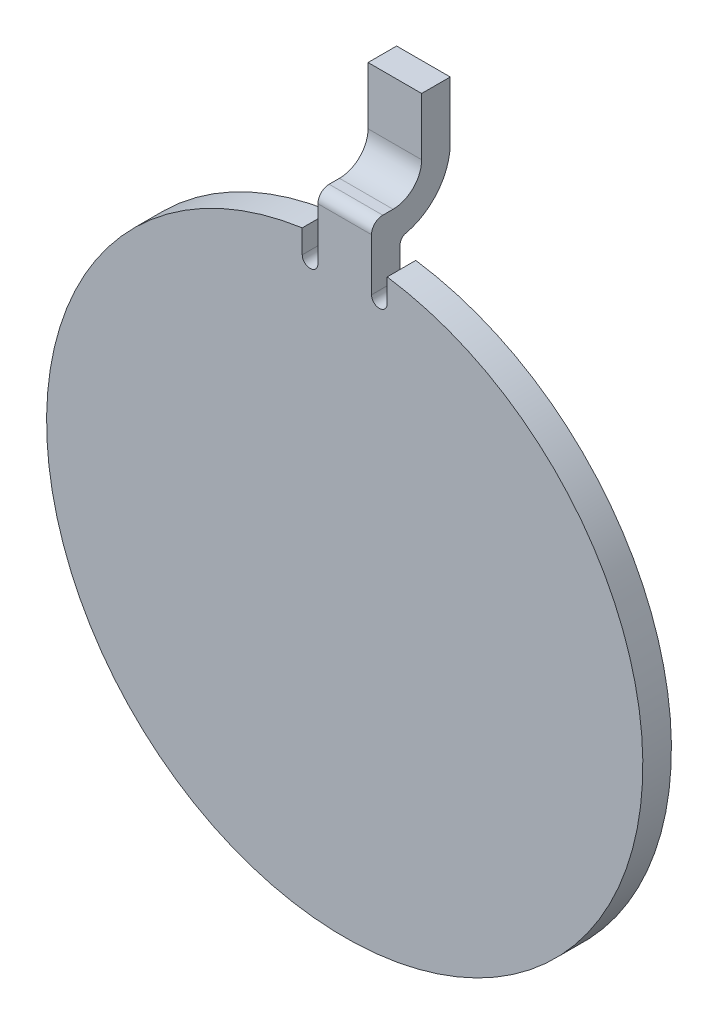
ISO-10303-21;
HEADER;
FILE_DESCRIPTION(('STEP AP214'),'2;1');
FILE_NAME('part.step','',(''),(''),'','','');
FILE_SCHEMA(('AUTOMOTIVE_DESIGN { 1 0 10303 214 1 1 1 1 }'));
ENDSEC;
DATA;
#1=APPLICATION_CONTEXT('core data for automotive mechanical design processes');
#2=APPLICATION_PROTOCOL_DEFINITION('international standard','automotive_design',2000,#1);
#3=PRODUCT_CONTEXT('',#1,'mechanical');
#4=PRODUCT('Part','Part','',(#3));
#5=PRODUCT_RELATED_PRODUCT_CATEGORY('part','',(#4));
#6=PRODUCT_DEFINITION_FORMATION('','',#4);
#7=PRODUCT_DEFINITION_CONTEXT('part definition',#1,'design');
#8=PRODUCT_DEFINITION('design','',#6,#7);
#9=PRODUCT_DEFINITION_SHAPE('','',#8);
#10=(LENGTH_UNIT() NAMED_UNIT(*) SI_UNIT(.MILLI.,.METRE.));
#11=(NAMED_UNIT(*) PLANE_ANGLE_UNIT() SI_UNIT($,.RADIAN.));
#12=(NAMED_UNIT(*) SI_UNIT($,.STERADIAN.) SOLID_ANGLE_UNIT());
#13=UNCERTAINTY_MEASURE_WITH_UNIT(LENGTH_MEASURE(1.E-05),#10,'distance_accuracy_value','');
#14=(GEOMETRIC_REPRESENTATION_CONTEXT(3) GLOBAL_UNCERTAINTY_ASSIGNED_CONTEXT((#13)) GLOBAL_UNIT_ASSIGNED_CONTEXT((#10,
#11,#12)) REPRESENTATION_CONTEXT('',''));
#15=CARTESIAN_POINT('',(0.,0.,0.));
#16=DIRECTION('',(0.,0.,1.));
#17=DIRECTION('',(1.,0.,0.));
#18=AXIS2_PLACEMENT_3D('',#15,#16,#17);
#19=CARTESIAN_POINT('',(-0.476507589397102,37.7055196206584,10.668));
#20=DIRECTION('',(0.,-1.,0.));
#21=DIRECTION('',(0.,0.,-1.));
#22=AXIS2_PLACEMENT_3D('',#19,#20,#21);
#23=PLANE('',#22);
#24=DIRECTION('',(0.,0.,1.));
#25=VECTOR('',#24,1.);
#26=CARTESIAN_POINT('',(-0.476507589397102,37.7055196206584,10.668));
#27=LINE('',#26,#25);
#28=CARTESIAN_POINT('',(-0.476507589397102,37.7055196206584,10.7928766138095));
#29=VERTEX_POINT('',#28);
#30=CARTESIAN_POINT('',(-0.476507589397102,37.7055196206584,10.976));
#31=VERTEX_POINT('',#30);
#32=EDGE_CURVE('E238',#29,#31,#27,.T.);
#33=ORIENTED_EDGE('',*,*,#32,.T.);
#34=DIRECTION('',(1.,0.,0.));
#35=VECTOR('',#34,1.);
#36=CARTESIAN_POINT('',(-0.476507589397102,37.7055196206584,10.976));
#37=LINE('',#36,#35);
#38=CARTESIAN_POINT('',(0.476507589397102,37.7055196206584,10.976));
#39=VERTEX_POINT('',#38);
#40=EDGE_CURVE('E251',#31,#39,#37,.T.);
#41=ORIENTED_EDGE('',*,*,#40,.T.);
#42=DIRECTION('',(0.,0.,1.));
#43=VECTOR('',#42,1.);
#44=CARTESIAN_POINT('',(0.476507589397102,37.7055196206584,10.668));
#45=LINE('',#44,#43);
#46=CARTESIAN_POINT('',(0.476507589397102,37.7055196206584,10.7928766138095));
#47=VERTEX_POINT('',#46);
#48=EDGE_CURVE('E233',#47,#39,#45,.T.);
#49=ORIENTED_EDGE('',*,*,#48,.F.);
#50=DIRECTION('',(-1.,0.,0.));
#51=VECTOR('',#50,1.);
#52=CARTESIAN_POINT('',(0.476507589397102,37.7055196206584,10.7928766138095));
#53=LINE('',#52,#51);
#54=EDGE_CURVE('E219',#47,#29,#53,.T.);
#55=ORIENTED_EDGE('',*,*,#54,.T.);
#56=EDGE_LOOP('',(#33,#41,#49,#55));
#57=FACE_BOUND('',#56,.T.);
#58=ADVANCED_FACE('F36',(#57),#23,.F.);
#59=CARTESIAN_POINT('',(0.,31.75,10.668));
#60=DIRECTION('',(0.,0.,-1.));
#61=DIRECTION('',(-1.,0.,0.));
#62=AXIS2_PLACEMENT_3D('',#59,#60,#61);
#63=PLANE('',#62);
#64=DIRECTION('',(0.,-1.,0.));
#65=VECTOR('',#64,1.);
#66=CARTESIAN_POINT('',(0.476507589397102,37.0276368196465,10.668));
#67=LINE('',#66,#65);
#68=CARTESIAN_POINT('',(0.476507589397102,37.0986173059169,10.668));
#69=VERTEX_POINT('',#68);
#70=CARTESIAN_POINT('',(0.476507589397102,36.5801523813832,10.668));
#71=VERTEX_POINT('',#70);
#72=EDGE_CURVE('E228',#69,#71,#67,.T.);
#73=ORIENTED_EDGE('',*,*,#72,.T.);
#74=CARTESIAN_POINT('',(0.615801998549159,36.5801523813832,10.668));
#75=DIRECTION('',(0.,0.,-1.));
#76=DIRECTION('',(1.,0.,0.));
#77=AXIS2_PLACEMENT_3D('',#74,#75,#76);
#78=CIRCLE('',#77,0.139294409152057);
#79=CARTESIAN_POINT('',(0.755096407701217,36.5801523813832,10.668));
#80=VERTEX_POINT('',#79);
#81=EDGE_CURVE('E159',#80,#71,#78,.T.);
#82=ORIENTED_EDGE('',*,*,#81,.F.);
#83=DIRECTION('',(0.,-1.,0.));
#84=VECTOR('',#83,1.);
#85=CARTESIAN_POINT('',(0.755096407701217,37.0838705948078,10.668));
#86=LINE('',#85,#84);
#87=CARTESIAN_POINT('',(0.755096407701217,36.9950299615844,10.668));
#88=VERTEX_POINT('',#87);
#89=EDGE_CURVE('E167',#88,#80,#86,.T.);
#90=ORIENTED_EDGE('',*,*,#89,.F.);
#91=CARTESIAN_POINT('',(0.,31.75,10.668));
#92=DIRECTION('',(0.,0.,-1.));
#93=DIRECTION('',(-1.,0.,0.));
#94=AXIS2_PLACEMENT_3D('',#91,#92,#93);
#95=CIRCLE('',#94,5.29910463029755);
#96=CARTESIAN_POINT('',(-0.755096407701217,36.9950299615844,10.668));
#97=VERTEX_POINT('',#96);
#98=EDGE_CURVE('E230',#88,#97,#95,.T.);
#99=ORIENTED_EDGE('',*,*,#98,.T.);
#100=DIRECTION('',(0.,1.,0.));
#101=VECTOR('',#100,1.);
#102=CARTESIAN_POINT('',(-0.755096407701217,37.0838705948078,10.668));
#103=LINE('',#102,#101);
#104=CARTESIAN_POINT('',(-0.755096407701217,36.5801523813832,10.668));
#105=VERTEX_POINT('',#104);
#106=EDGE_CURVE('E177',#105,#97,#103,.T.);
#107=ORIENTED_EDGE('',*,*,#106,.F.);
#108=CARTESIAN_POINT('',(-0.615801998549159,36.5801523813832,10.668));
#109=DIRECTION('',(0.,0.,-1.));
#110=DIRECTION('',(-1.,0.,0.));
#111=AXIS2_PLACEMENT_3D('',#108,#109,#110);
#112=CIRCLE('',#111,0.139294409152057);
#113=CARTESIAN_POINT('',(-0.476507589397102,36.5801523813832,10.668));
#114=VERTEX_POINT('',#113);
#115=EDGE_CURVE('E173',#114,#105,#112,.T.);
#116=ORIENTED_EDGE('',*,*,#115,.F.);
#117=DIRECTION('',(0.,1.,0.));
#118=VECTOR('',#117,1.);
#119=CARTESIAN_POINT('',(-0.476507589397102,37.0276368196465,10.668));
#120=LINE('',#119,#118);
#121=CARTESIAN_POINT('',(-0.476507589397102,37.0986173059169,10.668));
#122=VERTEX_POINT('',#121);
#123=EDGE_CURVE('E232',#114,#122,#120,.T.);
#124=ORIENTED_EDGE('',*,*,#123,.T.);
#125=DIRECTION('',(-1.,0.,0.));
#126=VECTOR('',#125,1.);
#127=CARTESIAN_POINT('',(0.,37.0986173059169,10.668));
#128=LINE('',#127,#126);
#129=EDGE_CURVE('E241',#122,#69,#128,.F.);
#130=ORIENTED_EDGE('',*,*,#129,.T.);
#131=EDGE_LOOP('',(#73,#82,#90,#99,#107,#116,#124,#130));
#132=FACE_BOUND('',#131,.T.);
#133=ADVANCED_FACE('F279',(#132),#63,.T.);
#134=CARTESIAN_POINT('',(0.476507589397102,37.0276368196465,10.668));
#135=DIRECTION('',(-1.,0.,0.));
#136=DIRECTION('',(0.,0.,1.));
#137=AXIS2_PLACEMENT_3D('',#134,#135,#136);
#138=PLANE('',#137);
#139=DIRECTION('',(0.,-1.,0.));
#140=VECTOR('',#139,1.);
#141=CARTESIAN_POINT('',(0.476507589397102,37.0276368196465,11.176));
#142=LINE('',#141,#140);
#143=CARTESIAN_POINT('',(0.476507589397102,37.5055196206584,11.176));
#144=VERTEX_POINT('',#143);
#145=CARTESIAN_POINT('',(0.476507589397102,36.5801523813832,11.176));
#146=VERTEX_POINT('',#145);
#147=EDGE_CURVE('E146',#144,#146,#142,.T.);
#148=ORIENTED_EDGE('',*,*,#147,.T.);
#149=DIRECTION('',(0.,0.,-1.));
#150=VECTOR('',#149,1.);
#151=CARTESIAN_POINT('',(0.476507589397102,36.5801523813832,11.176));
#152=LINE('',#151,#150);
#153=EDGE_CURVE('E149',#146,#71,#152,.T.);
#154=ORIENTED_EDGE('',*,*,#153,.T.);
#155=ORIENTED_EDGE('',*,*,#72,.F.);
#156=CARTESIAN_POINT('',(0.476507589397102,37.0986173059169,10.541));
#157=DIRECTION('',(-1.,0.,0.));
#158=DIRECTION('',(0.,0.,1.));
#159=AXIS2_PLACEMENT_3D('',#156,#157,#158);
#160=CIRCLE('',#159,0.127);
#161=CARTESIAN_POINT('',(0.476507589397102,37.2224953408882,10.5689862904233));
#162=VERTEX_POINT('',#161);
#163=EDGE_CURVE('E246',#69,#162,#160,.T.);
#164=ORIENTED_EDGE('',*,*,#163,.T.);
#165=CARTESIAN_POINT('',(0.476507589397102,38.2135196206584,10.7928766138095));
#166=DIRECTION('',(-1.,0.,0.));
#167=DIRECTION('',(0.,0.,1.));
#168=AXIS2_PLACEMENT_3D('',#165,#166,#167);
#169=CIRCLE('',#168,1.016);
#170=CARTESIAN_POINT('',(0.476507589397102,38.2135196206584,9.7768766138095));
#171=VERTEX_POINT('',#170);
#172=EDGE_CURVE('E201',#162,#171,#169,.F.);
#173=ORIENTED_EDGE('',*,*,#172,.T.);
#174=DIRECTION('',(0.,1.,0.));
#175=VECTOR('',#174,1.);
#176=CARTESIAN_POINT('',(0.476507589397102,38.2135196206584,9.7768766138095));
#177=LINE('',#176,#175);
#178=CARTESIAN_POINT('',(0.476507589397102,39.2339446156029,9.7768766138095));
#179=VERTEX_POINT('',#178);
#180=EDGE_CURVE('E199',#171,#179,#177,.T.);
#181=ORIENTED_EDGE('',*,*,#180,.T.);
#182=DIRECTION('',(0.,0.,1.));
#183=VECTOR('',#182,1.);
#184=CARTESIAN_POINT('',(0.476507589397102,39.2339446156029,9.7768766138095));
#185=LINE('',#184,#183);
#186=CARTESIAN_POINT('',(0.476507589397102,39.2339446156029,10.2848766138095));
#187=VERTEX_POINT('',#186);
#188=EDGE_CURVE('E196',#179,#187,#185,.T.);
#189=ORIENTED_EDGE('',*,*,#188,.T.);
#190=DIRECTION('',(0.,1.,0.));
#191=VECTOR('',#190,1.);
#192=CARTESIAN_POINT('',(0.476507589397102,38.2135196206584,10.2848766138095));
#193=LINE('',#192,#191);
#194=CARTESIAN_POINT('',(0.476507589397102,38.2135196206584,10.2848766138095));
#195=VERTEX_POINT('',#194);
#196=EDGE_CURVE('E193',#195,#187,#193,.T.);
#197=ORIENTED_EDGE('',*,*,#196,.F.);
#198=CARTESIAN_POINT('',(0.476507589397102,38.2135196206584,10.7928766138095));
#199=DIRECTION('',(1.,0.,0.));
#200=DIRECTION('',(0.,0.,-1.));
#201=AXIS2_PLACEMENT_3D('',#198,#199,#200);
#202=CIRCLE('',#201,0.508000000000001);
#203=EDGE_CURVE('E203',#47,#195,#202,.T.);
#204=ORIENTED_EDGE('',*,*,#203,.F.);
#205=ORIENTED_EDGE('',*,*,#48,.T.);
#206=CARTESIAN_POINT('',(0.476507589397102,37.5055196206584,10.976));
#207=DIRECTION('',(-1.,0.,0.));
#208=DIRECTION('',(0.,0.,1.));
#209=AXIS2_PLACEMENT_3D('',#206,#207,#208);
#210=CIRCLE('',#209,0.2);
#211=EDGE_CURVE('E152',#39,#144,#210,.F.);
#212=ORIENTED_EDGE('',*,*,#211,.T.);
#213=EDGE_LOOP('',(#148,#154,#155,#164,#173,#181,#189,#197,#204,#205,#212));
#214=FACE_BOUND('',#213,.T.);
#215=ADVANCED_FACE('F147',(#214),#138,.F.);
#216=CARTESIAN_POINT('',(0.,31.75,10.668));
#217=DIRECTION('',(0.,0.,1.));
#218=DIRECTION('',(1.,0.,0.));
#219=AXIS2_PLACEMENT_3D('',#216,#217,#218);
#220=CYLINDRICAL_SURFACE('',#219,5.29910463029755);
#221=ORIENTED_EDGE('',*,*,#98,.F.);
#222=DIRECTION('',(0.,0.,1.));
#223=VECTOR('',#222,1.);
#224=CARTESIAN_POINT('',(0.755096407701217,36.9950299615844,10.668));
#225=LINE('',#224,#223);
#226=CARTESIAN_POINT('',(0.755096407701217,36.9950299615844,11.176));
#227=VERTEX_POINT('',#226);
#228=EDGE_CURVE('E160',#88,#227,#225,.T.);
#229=ORIENTED_EDGE('',*,*,#228,.T.);
#230=CARTESIAN_POINT('',(0.,31.75,11.176));
#231=DIRECTION('',(0.,0.,-1.));
#232=DIRECTION('',(-1.,0.,0.));
#233=AXIS2_PLACEMENT_3D('',#230,#231,#232);
#234=CIRCLE('',#233,5.29910463029755);
#235=CARTESIAN_POINT('',(-0.755096407701217,36.9950299615844,11.176));
#236=VERTEX_POINT('',#235);
#237=EDGE_CURVE('E154',#227,#236,#234,.T.);
#238=ORIENTED_EDGE('',*,*,#237,.T.);
#239=DIRECTION('',(0.,0.,1.));
#240=VECTOR('',#239,1.);
#241=CARTESIAN_POINT('',(-0.755096407701217,36.9950299615844,10.668));
#242=LINE('',#241,#240);
#243=EDGE_CURVE('E187',#236,#97,#242,.F.);
#244=ORIENTED_EDGE('',*,*,#243,.T.);
#245=EDGE_LOOP('',(#221,#229,#238,#244));
#246=FACE_BOUND('',#245,.T.);
#247=ADVANCED_FACE('F290',(#246),#220,.T.);
#248=CARTESIAN_POINT('',(-0.476507589397102,37.0276368196465,10.668));
#249=DIRECTION('',(1.,0.,0.));
#250=DIRECTION('',(0.,0.,-1.));
#251=AXIS2_PLACEMENT_3D('',#248,#249,#250);
#252=PLANE('',#251);
#253=DIRECTION('',(0.,1.,0.));
#254=VECTOR('',#253,1.);
#255=CARTESIAN_POINT('',(-0.476507589397102,37.0276368196465,11.176));
#256=LINE('',#255,#254);
#257=CARTESIAN_POINT('',(-0.476507589397102,36.5801523813832,11.176));
#258=VERTEX_POINT('',#257);
#259=CARTESIAN_POINT('',(-0.476507589397102,37.5055196206584,11.176));
#260=VERTEX_POINT('',#259);
#261=EDGE_CURVE('E59',#258,#260,#256,.T.);
#262=ORIENTED_EDGE('',*,*,#261,.T.);
#263=CARTESIAN_POINT('',(-0.476507589397102,37.5055196206584,10.976));
#264=DIRECTION('',(1.,0.,0.));
#265=DIRECTION('',(0.,0.,-1.));
#266=AXIS2_PLACEMENT_3D('',#263,#264,#265);
#267=CIRCLE('',#266,0.2);
#268=EDGE_CURVE('E44',#260,#31,#267,.F.);
#269=ORIENTED_EDGE('',*,*,#268,.T.);
#270=ORIENTED_EDGE('',*,*,#32,.F.);
#271=CARTESIAN_POINT('',(-0.476507589397102,38.2135196206584,10.7928766138095));
#272=DIRECTION('',(1.,0.,0.));
#273=DIRECTION('',(0.,0.,-1.));
#274=AXIS2_PLACEMENT_3D('',#271,#272,#273);
#275=CIRCLE('',#274,0.508000000000001);
#276=CARTESIAN_POINT('',(-0.476507589397102,38.2135196206584,10.2848766138095));
#277=VERTEX_POINT('',#276);
#278=EDGE_CURVE('E197',#29,#277,#275,.T.);
#279=ORIENTED_EDGE('',*,*,#278,.T.);
#280=DIRECTION('',(0.,1.,0.));
#281=VECTOR('',#280,1.);
#282=CARTESIAN_POINT('',(-0.476507589397102,38.2135196206584,10.2848766138095));
#283=LINE('',#282,#281);
#284=CARTESIAN_POINT('',(-0.476507589397102,39.2339446156029,10.2848766138095));
#285=VERTEX_POINT('',#284);
#286=EDGE_CURVE('E192',#277,#285,#283,.T.);
#287=ORIENTED_EDGE('',*,*,#286,.T.);
#288=DIRECTION('',(0.,0.,1.));
#289=VECTOR('',#288,1.);
#290=CARTESIAN_POINT('',(-0.476507589397102,39.2339446156029,9.7768766138095));
#291=LINE('',#290,#289);
#292=CARTESIAN_POINT('',(-0.476507589397102,39.2339446156029,9.7768766138095));
#293=VERTEX_POINT('',#292);
#294=EDGE_CURVE('E209',#293,#285,#291,.T.);
#295=ORIENTED_EDGE('',*,*,#294,.F.);
#296=DIRECTION('',(0.,1.,0.));
#297=VECTOR('',#296,1.);
#298=CARTESIAN_POINT('',(-0.476507589397102,38.2135196206584,9.7768766138095));
#299=LINE('',#298,#297);
#300=CARTESIAN_POINT('',(-0.476507589397102,38.2135196206584,9.7768766138095));
#301=VERTEX_POINT('',#300);
#302=EDGE_CURVE('E212',#301,#293,#299,.T.);
#303=ORIENTED_EDGE('',*,*,#302,.F.);
#304=CARTESIAN_POINT('',(-0.476507589397102,38.2135196206584,10.7928766138095));
#305=DIRECTION('',(-1.,0.,0.));
#306=DIRECTION('',(0.,0.,1.));
#307=AXIS2_PLACEMENT_3D('',#304,#305,#306);
#308=CIRCLE('',#307,1.016);
#309=CARTESIAN_POINT('',(-0.476507589397102,37.2224953408882,10.5689862904233));
#310=VERTEX_POINT('',#309);
#311=EDGE_CURVE('E214',#310,#301,#308,.F.);
#312=ORIENTED_EDGE('',*,*,#311,.F.);
#313=CARTESIAN_POINT('',(-0.476507589397102,37.0986173059169,10.541));
#314=DIRECTION('',(1.,0.,0.));
#315=DIRECTION('',(0.,0.,-1.));
#316=AXIS2_PLACEMENT_3D('',#313,#314,#315);
#317=CIRCLE('',#316,0.127);
#318=EDGE_CURVE('E248',#310,#122,#317,.T.);
#319=ORIENTED_EDGE('',*,*,#318,.T.);
#320=ORIENTED_EDGE('',*,*,#123,.F.);
#321=DIRECTION('',(0.,0.,-1.));
#322=VECTOR('',#321,1.);
#323=CARTESIAN_POINT('',(-0.476507589397102,36.5801523813832,11.176));
#324=LINE('',#323,#322);
#325=EDGE_CURVE('E180',#258,#114,#324,.T.);
#326=ORIENTED_EDGE('',*,*,#325,.F.);
#327=EDGE_LOOP('',(#262,#269,#270,#279,#287,#295,#303,#312,#319,#320,#326));
#328=FACE_BOUND('',#327,.T.);
#329=ADVANCED_FACE('F259',(#328),#252,.F.);
#330=CARTESIAN_POINT('',(0.,31.75,11.176));
#331=DIRECTION('',(0.,0.,-1.));
#332=DIRECTION('',(-1.,0.,0.));
#333=AXIS2_PLACEMENT_3D('',#330,#331,#332);
#334=PLANE('',#333);
#335=CARTESIAN_POINT('',(0.615801998549159,36.5801523813832,11.176));
#336=DIRECTION('',(0.,0.,-1.));
#337=DIRECTION('',(1.,0.,0.));
#338=AXIS2_PLACEMENT_3D('',#335,#336,#337);
#339=CIRCLE('',#338,0.139294409152057);
#340=CARTESIAN_POINT('',(0.755096407701217,36.5801523813832,11.176));
#341=VERTEX_POINT('',#340);
#342=EDGE_CURVE('E51',#341,#146,#339,.T.);
#343=ORIENTED_EDGE('',*,*,#342,.T.);
#344=ORIENTED_EDGE('',*,*,#147,.F.);
#345=DIRECTION('',(1.,0.,0.));
#346=VECTOR('',#345,1.);
#347=CARTESIAN_POINT('',(0.,37.5055196206584,11.176));
#348=LINE('',#347,#346);
#349=EDGE_CURVE('E255',#144,#260,#348,.F.);
#350=ORIENTED_EDGE('',*,*,#349,.T.);
#351=ORIENTED_EDGE('',*,*,#261,.F.);
#352=CARTESIAN_POINT('',(-0.615801998549159,36.5801523813832,11.176));
#353=DIRECTION('',(0.,0.,-1.));
#354=DIRECTION('',(-1.,0.,0.));
#355=AXIS2_PLACEMENT_3D('',#352,#353,#354);
#356=CIRCLE('',#355,0.139294409152057);
#357=CARTESIAN_POINT('',(-0.755096407701217,36.5801523813832,11.176));
#358=VERTEX_POINT('',#357);
#359=EDGE_CURVE('E174',#258,#358,#356,.T.);
#360=ORIENTED_EDGE('',*,*,#359,.T.);
#361=DIRECTION('',(0.,1.,0.));
#362=VECTOR('',#361,1.);
#363=CARTESIAN_POINT('',(-0.755096407701217,37.0838705948078,11.176));
#364=LINE('',#363,#362);
#365=EDGE_CURVE('E176',#358,#236,#364,.T.);
#366=ORIENTED_EDGE('',*,*,#365,.T.);
#367=ORIENTED_EDGE('',*,*,#237,.F.);
#368=DIRECTION('',(0.,-1.,0.));
#369=VECTOR('',#368,1.);
#370=CARTESIAN_POINT('',(0.755096407701215,31.75,11.176));
#371=LINE('',#370,#369);
#372=EDGE_CURVE('E11',#227,#341,#371,.T.);
#373=ORIENTED_EDGE('',*,*,#372,.T.);
#374=EDGE_LOOP('',(#343,#344,#350,#351,#360,#366,#367,#373));
#375=FACE_BOUND('',#374,.T.);
#376=ADVANCED_FACE('F163',(#375),#334,.F.);
#377=CARTESIAN_POINT('',(0.476507589397102,38.2135196206584,10.2848766138095));
#378=DIRECTION('',(0.,0.,1.));
#379=DIRECTION('',(1.,0.,0.));
#380=AXIS2_PLACEMENT_3D('',#377,#378,#379);
#381=PLANE('',#380);
#382=ORIENTED_EDGE('',*,*,#286,.F.);
#383=DIRECTION('',(-1.,0.,0.));
#384=VECTOR('',#383,1.);
#385=CARTESIAN_POINT('',(0.476507589397102,38.2135196206584,10.2848766138095));
#386=LINE('',#385,#384);
#387=EDGE_CURVE('E155',#195,#277,#386,.T.);
#388=ORIENTED_EDGE('',*,*,#387,.F.);
#389=ORIENTED_EDGE('',*,*,#196,.T.);
#390=DIRECTION('',(-1.,0.,0.));
#391=VECTOR('',#390,1.);
#392=CARTESIAN_POINT('',(0.476507589397102,39.2339446156029,10.2848766138095));
#393=LINE('',#392,#391);
#394=EDGE_CURVE('E206',#187,#285,#393,.T.);
#395=ORIENTED_EDGE('',*,*,#394,.T.);
#396=EDGE_LOOP('',(#382,#388,#389,#395));
#397=FACE_BOUND('',#396,.T.);
#398=ADVANCED_FACE('F313',(#397),#381,.T.);
#399=CARTESIAN_POINT('',(0.476507589397102,38.2135196206584,10.7928766138095));
#400=DIRECTION('',(-1.,0.,0.));
#401=DIRECTION('',(0.,0.,1.));
#402=AXIS2_PLACEMENT_3D('',#399,#400,#401);
#403=CYLINDRICAL_SURFACE('',#402,0.508000000000001);
#404=ORIENTED_EDGE('',*,*,#278,.F.);
#405=ORIENTED_EDGE('',*,*,#54,.F.);
#406=ORIENTED_EDGE('',*,*,#203,.T.);
#407=ORIENTED_EDGE('',*,*,#387,.T.);
#408=EDGE_LOOP('',(#404,#405,#406,#407));
#409=FACE_BOUND('',#408,.T.);
#410=ADVANCED_FACE('F319',(#409),#403,.F.);
#411=CARTESIAN_POINT('',(0.476507589397102,38.2135196206584,10.7928766138095));
#412=DIRECTION('',(-1.,0.,0.));
#413=DIRECTION('',(0.,0.,1.));
#414=AXIS2_PLACEMENT_3D('',#411,#412,#413);
#415=CYLINDRICAL_SURFACE('',#414,1.016);
#416=ORIENTED_EDGE('',*,*,#172,.F.);
#417=DIRECTION('',(-1.,0.,0.));
#418=VECTOR('',#417,1.);
#419=CARTESIAN_POINT('',(0.476507589397102,37.2224953408882,10.5689862904233));
#420=LINE('',#419,#418);
#421=EDGE_CURVE('E244',#162,#310,#420,.T.);
#422=ORIENTED_EDGE('',*,*,#421,.T.);
#423=ORIENTED_EDGE('',*,*,#311,.T.);
#424=DIRECTION('',(-1.,0.,0.));
#425=VECTOR('',#424,1.);
#426=CARTESIAN_POINT('',(0.476507589397102,38.2135196206584,9.7768766138095));
#427=LINE('',#426,#425);
#428=EDGE_CURVE('E221',#171,#301,#427,.T.);
#429=ORIENTED_EDGE('',*,*,#428,.F.);
#430=EDGE_LOOP('',(#416,#422,#423,#429));
#431=FACE_BOUND('',#430,.T.);
#432=ADVANCED_FACE('F327',(#431),#415,.T.);
#433=CARTESIAN_POINT('',(0.476507589397102,38.2135196206584,9.7768766138095));
#434=DIRECTION('',(0.,0.,1.));
#435=DIRECTION('',(1.,0.,0.));
#436=AXIS2_PLACEMENT_3D('',#433,#434,#435);
#437=PLANE('',#436);
#438=ORIENTED_EDGE('',*,*,#302,.T.);
#439=DIRECTION('',(-1.,0.,0.));
#440=VECTOR('',#439,1.);
#441=CARTESIAN_POINT('',(0.476507589397102,39.2339446156029,9.7768766138095));
#442=LINE('',#441,#440);
#443=EDGE_CURVE('E224',#179,#293,#442,.T.);
#444=ORIENTED_EDGE('',*,*,#443,.F.);
#445=ORIENTED_EDGE('',*,*,#180,.F.);
#446=ORIENTED_EDGE('',*,*,#428,.T.);
#447=EDGE_LOOP('',(#438,#444,#445,#446));
#448=FACE_BOUND('',#447,.T.);
#449=ADVANCED_FACE('F335',(#448),#437,.F.);
#450=CARTESIAN_POINT('',(0.476507589397102,39.2339446156029,9.7768766138095));
#451=DIRECTION('',(0.,-1.,0.));
#452=DIRECTION('',(0.,0.,-1.));
#453=AXIS2_PLACEMENT_3D('',#450,#451,#452);
#454=PLANE('',#453);
#455=ORIENTED_EDGE('',*,*,#294,.T.);
#456=ORIENTED_EDGE('',*,*,#394,.F.);
#457=ORIENTED_EDGE('',*,*,#188,.F.);
#458=ORIENTED_EDGE('',*,*,#443,.T.);
#459=EDGE_LOOP('',(#455,#456,#457,#458));
#460=FACE_BOUND('',#459,.T.);
#461=ADVANCED_FACE('F276',(#460),#454,.F.);
#462=CARTESIAN_POINT('',(0.476507589397102,37.0986173059169,10.541));
#463=DIRECTION('',(-1.,0.,0.));
#464=DIRECTION('',(0.,0.,1.));
#465=AXIS2_PLACEMENT_3D('',#462,#463,#464);
#466=CYLINDRICAL_SURFACE('',#465,0.127);
#467=ORIENTED_EDGE('',*,*,#318,.F.);
#468=ORIENTED_EDGE('',*,*,#421,.F.);
#469=ORIENTED_EDGE('',*,*,#163,.F.);
#470=ORIENTED_EDGE('',*,*,#129,.F.);
#471=EDGE_LOOP('',(#467,#468,#469,#470));
#472=FACE_BOUND('',#471,.T.);
#473=ADVANCED_FACE('F268',(#472),#466,.F.);
#474=CARTESIAN_POINT('',(-0.476507589397102,37.5055196206584,10.976));
#475=DIRECTION('',(1.,0.,0.));
#476=DIRECTION('',(0.,0.,-1.));
#477=AXIS2_PLACEMENT_3D('',#474,#475,#476);
#478=CYLINDRICAL_SURFACE('',#477,0.2);
#479=ORIENTED_EDGE('',*,*,#268,.F.);
#480=ORIENTED_EDGE('',*,*,#349,.F.);
#481=ORIENTED_EDGE('',*,*,#211,.F.);
#482=ORIENTED_EDGE('',*,*,#40,.F.);
#483=EDGE_LOOP('',(#479,#480,#481,#482));
#484=FACE_BOUND('',#483,.T.);
#485=ADVANCED_FACE('F38',(#484),#478,.T.);
#486=CARTESIAN_POINT('',(-0.755096407701217,37.0838705948078,11.176));
#487=DIRECTION('',(-1.,0.,0.));
#488=DIRECTION('',(0.,-1.,0.));
#489=AXIS2_PLACEMENT_3D('',#486,#487,#488);
#490=PLANE('',#489);
#491=ORIENTED_EDGE('',*,*,#365,.F.);
#492=DIRECTION('',(0.,0.,-1.));
#493=VECTOR('',#492,1.);
#494=CARTESIAN_POINT('',(-0.755096407701217,36.5801523813832,11.176));
#495=LINE('',#494,#493);
#496=EDGE_CURVE('E185',#358,#105,#495,.T.);
#497=ORIENTED_EDGE('',*,*,#496,.T.);
#498=ORIENTED_EDGE('',*,*,#106,.T.);
#499=ORIENTED_EDGE('',*,*,#243,.F.);
#500=EDGE_LOOP('',(#491,#497,#498,#499));
#501=FACE_BOUND('',#500,.T.);
#502=ADVANCED_FACE('F267',(#501),#490,.F.);
#503=CARTESIAN_POINT('',(-0.615801998549159,36.5801523813832,11.176));
#504=DIRECTION('',(0.,0.,-1.));
#505=DIRECTION('',(-1.,0.,0.));
#506=AXIS2_PLACEMENT_3D('',#503,#504,#505);
#507=CYLINDRICAL_SURFACE('',#506,0.139294409152057);
#508=ORIENTED_EDGE('',*,*,#115,.T.);
#509=ORIENTED_EDGE('',*,*,#496,.F.);
#510=ORIENTED_EDGE('',*,*,#359,.F.);
#511=ORIENTED_EDGE('',*,*,#325,.T.);
#512=EDGE_LOOP('',(#508,#509,#510,#511));
#513=FACE_BOUND('',#512,.T.);
#514=ADVANCED_FACE('F273',(#513),#507,.F.);
#515=CARTESIAN_POINT('',(0.755096407701217,37.0838705948078,11.176));
#516=DIRECTION('',(1.,0.,0.));
#517=DIRECTION('',(0.,1.,0.));
#518=AXIS2_PLACEMENT_3D('',#515,#516,#517);
#519=PLANE('',#518);
#520=ORIENTED_EDGE('',*,*,#89,.T.);
#521=DIRECTION('',(0.,0.,-1.));
#522=VECTOR('',#521,1.);
#523=CARTESIAN_POINT('',(0.755096407701217,36.5801523813832,11.176));
#524=LINE('',#523,#522);
#525=EDGE_CURVE('E161',#341,#80,#524,.T.);
#526=ORIENTED_EDGE('',*,*,#525,.F.);
#527=ORIENTED_EDGE('',*,*,#372,.F.);
#528=ORIENTED_EDGE('',*,*,#228,.F.);
#529=EDGE_LOOP('',(#520,#526,#527,#528));
#530=FACE_BOUND('',#529,.T.);
#531=ADVANCED_FACE('F374',(#530),#519,.F.);
#532=CARTESIAN_POINT('',(0.615801998549159,36.5801523813832,11.176));
#533=DIRECTION('',(0.,0.,-1.));
#534=DIRECTION('',(-1.,0.,0.));
#535=AXIS2_PLACEMENT_3D('',#532,#533,#534);
#536=CYLINDRICAL_SURFACE('',#535,0.139294409152057);
#537=ORIENTED_EDGE('',*,*,#81,.T.);
#538=ORIENTED_EDGE('',*,*,#153,.F.);
#539=ORIENTED_EDGE('',*,*,#342,.F.);
#540=ORIENTED_EDGE('',*,*,#525,.T.);
#541=EDGE_LOOP('',(#537,#538,#539,#540));
#542=FACE_BOUND('',#541,.T.);
#543=ADVANCED_FACE('F157',(#542),#536,.F.);
#544=CLOSED_SHELL('',(#58,#133,#215,#247,#329,#376,#398,#410,#432,#449,#461,#473,#485,#502,#514,
#531,#543));
#545=MANIFOLD_SOLID_BREP('B2',#544);
#546=ADVANCED_BREP_SHAPE_REPRESENTATION('',(#18,#545),#14);
#547=SHAPE_DEFINITION_REPRESENTATION(#9,#546);
ENDSEC;
END-ISO-10303-21;
